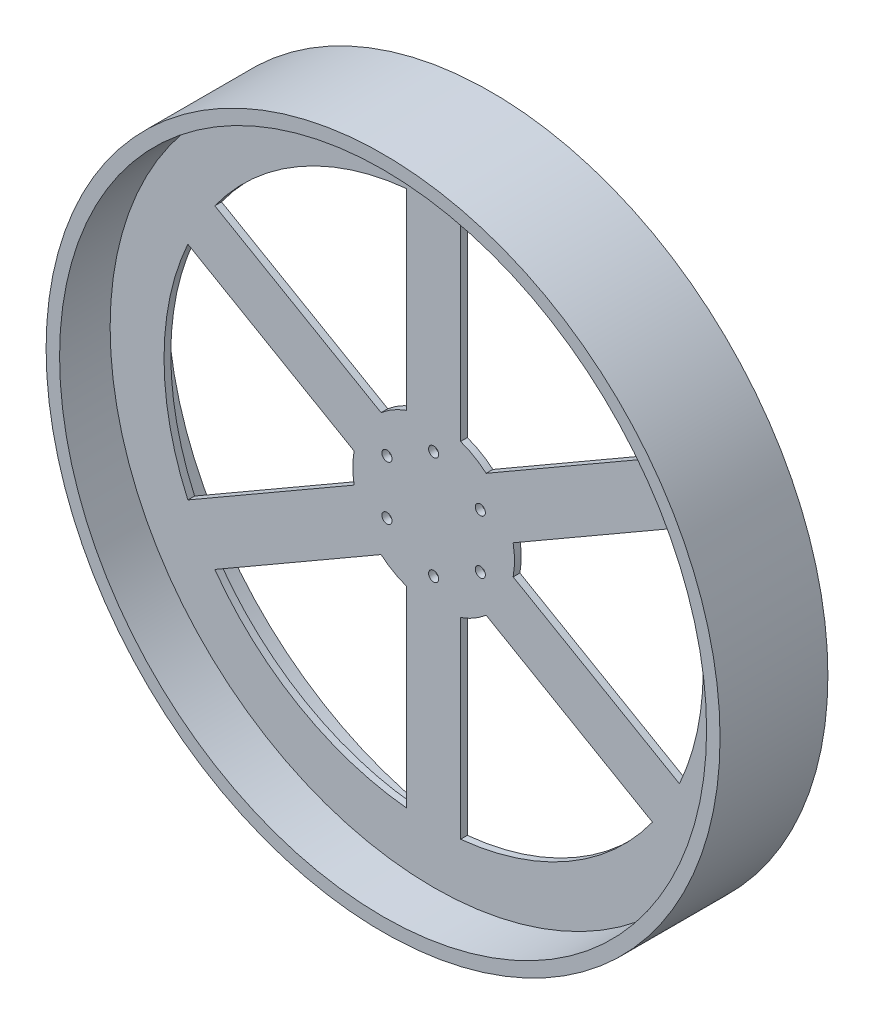
ISO-10303-21;
HEADER;
FILE_DESCRIPTION(('STEP AP214'),'2;1');
FILE_NAME('part.step','',(''),(''),'','','');
FILE_SCHEMA(('AUTOMOTIVE_DESIGN { 1 0 10303 214 1 1 1 1 }'));
ENDSEC;
DATA;
#1=APPLICATION_CONTEXT('core data for automotive mechanical design processes');
#2=APPLICATION_PROTOCOL_DEFINITION('international standard','automotive_design',2000,#1);
#3=PRODUCT_CONTEXT('',#1,'mechanical');
#4=PRODUCT('Part','Part','',(#3));
#5=PRODUCT_RELATED_PRODUCT_CATEGORY('part','',(#4));
#6=PRODUCT_DEFINITION_FORMATION('','',#4);
#7=PRODUCT_DEFINITION_CONTEXT('part definition',#1,'design');
#8=PRODUCT_DEFINITION('design','',#6,#7);
#9=PRODUCT_DEFINITION_SHAPE('','',#8);
#10=(LENGTH_UNIT() NAMED_UNIT(*) SI_UNIT(.MILLI.,.METRE.));
#11=(NAMED_UNIT(*) PLANE_ANGLE_UNIT() SI_UNIT($,.RADIAN.));
#12=(NAMED_UNIT(*) SI_UNIT($,.STERADIAN.) SOLID_ANGLE_UNIT());
#13=UNCERTAINTY_MEASURE_WITH_UNIT(LENGTH_MEASURE(1.E-05),#10,'distance_accuracy_value','');
#14=(GEOMETRIC_REPRESENTATION_CONTEXT(3) GLOBAL_UNCERTAINTY_ASSIGNED_CONTEXT((#13)) GLOBAL_UNIT_ASSIGNED_CONTEXT((#10,
#11,#12)) REPRESENTATION_CONTEXT('',''));
#15=CARTESIAN_POINT('',(0.,0.,0.));
#16=DIRECTION('',(0.,0.,1.));
#17=DIRECTION('',(1.,0.,0.));
#18=AXIS2_PLACEMENT_3D('',#15,#16,#17);
#19=CARTESIAN_POINT('',(0.,0.,-3.175));
#20=DIRECTION('',(0.,0.,1.));
#21=DIRECTION('',(1.,0.,0.));
#22=AXIS2_PLACEMENT_3D('',#19,#20,#21);
#23=CYLINDRICAL_SURFACE('',#22,76.2);
#24=DIRECTION('',(0.,0.,1.));
#25=VECTOR('',#24,1.);
#26=CARTESIAN_POINT('',(25.4000000000005,71.8420489685531,-3.175));
#27=LINE('',#26,#25);
#28=CARTESIAN_POINT('',(25.4000000000005,71.8420489685531,-3.175));
#29=VERTEX_POINT('',#28);
#30=CARTESIAN_POINT('',(25.4000000000005,71.8420489685531,3.175));
#31=VERTEX_POINT('',#30);
#32=EDGE_CURVE('E328',#29,#31,#27,.T.);
#33=ORIENTED_EDGE('',*,*,#32,.T.);
#34=CARTESIAN_POINT('',(0.,0.,3.175));
#35=DIRECTION('',(0.,0.,1.));
#36=DIRECTION('',(1.,0.,0.));
#37=AXIS2_PLACEMENT_3D('',#34,#35,#36);
#38=CIRCLE('',#37,76.2);
#39=CARTESIAN_POINT('',(49.5170394666933,57.9180697404009,3.175));
#40=VERTEX_POINT('',#39);
#41=EDGE_CURVE('E220',#40,#31,#38,.T.);
#42=ORIENTED_EDGE('',*,*,#41,.F.);
#43=DIRECTION('',(0.,0.,1.));
#44=VECTOR('',#43,1.);
#45=CARTESIAN_POINT('',(49.5170394666933,57.9180697404009,-3.175));
#46=LINE('',#45,#44);
#47=CARTESIAN_POINT('',(49.5170394666933,57.9180697404009,-3.175));
#48=VERTEX_POINT('',#47);
#49=EDGE_CURVE('E11',#48,#40,#46,.T.);
#50=ORIENTED_EDGE('',*,*,#49,.F.);
#51=CARTESIAN_POINT('',(0.,0.,-3.175));
#52=DIRECTION('',(0.,0.,1.));
#53=DIRECTION('',(1.,0.,0.));
#54=AXIS2_PLACEMENT_3D('',#51,#52,#53);
#55=CIRCLE('',#54,76.2);
#56=EDGE_CURVE('E279',#48,#29,#55,.T.);
#57=ORIENTED_EDGE('',*,*,#56,.T.);
#58=EDGE_LOOP('',(#33,#42,#50,#57));
#59=FACE_BOUND('',#58,.T.);
#60=ADVANCED_FACE('F38',(#59),#23,.T.);
#61=CARTESIAN_POINT('',(-12.6999999999998,21.9970452561249,-3.175));
#62=DIRECTION('',(0.499999999999992,-0.866025403784443,0.));
#63=DIRECTION('',(0.866025403784443,0.499999999999992,0.));
#64=AXIS2_PLACEMENT_3D('',#61,#62,#63);
#65=PLANE('',#64);
#66=ORIENTED_EDGE('',*,*,#49,.T.);
#67=DIRECTION('',(0.866025403784443,0.499999999999992,0.));
#68=VECTOR('',#67,1.);
#69=CARTESIAN_POINT('',(-12.6999999999998,21.9970452561249,3.175));
#70=LINE('',#69,#68);
#71=CARTESIAN_POINT('',(206.1678368331,148.360449768664,3.175));
#72=VERTEX_POINT('',#71);
#73=EDGE_CURVE('E272',#40,#72,#70,.T.);
#74=ORIENTED_EDGE('',*,*,#73,.T.);
#75=DIRECTION('',(0.,0.,1.));
#76=VECTOR('',#75,1.);
#77=CARTESIAN_POINT('',(206.1678368331,148.360449768664,-3.175));
#78=LINE('',#77,#76);
#79=CARTESIAN_POINT('',(206.1678368331,148.360449768664,-3.175));
#80=VERTEX_POINT('',#79);
#81=EDGE_CURVE('E47',#80,#72,#78,.T.);
#82=ORIENTED_EDGE('',*,*,#81,.F.);
#83=DIRECTION('',(0.866025403784443,0.499999999999992,0.));
#84=VECTOR('',#83,1.);
#85=CARTESIAN_POINT('',(-12.6999999999998,21.9970452561249,-3.175));
#86=LINE('',#85,#84);
#87=EDGE_CURVE('E321',#48,#80,#86,.T.);
#88=ORIENTED_EDGE('',*,*,#87,.F.);
#89=EDGE_LOOP('',(#66,#74,#82,#88));
#90=FACE_BOUND('',#89,.T.);
#91=ADVANCED_FACE('F420',(#90),#65,.F.);
#92=CARTESIAN_POINT('',(0.,0.,-3.175));
#93=DIRECTION('',(0.,0.,1.));
#94=DIRECTION('',(1.,0.,0.));
#95=AXIS2_PLACEMENT_3D('',#92,#93,#94);
#96=CYLINDRICAL_SURFACE('',#95,254.);
#97=ORIENTED_EDGE('',*,*,#81,.T.);
#98=CARTESIAN_POINT('',(0.,0.,3.175));
#99=DIRECTION('',(0.,0.,1.));
#100=DIRECTION('',(1.,0.,0.));
#101=AXIS2_PLACEMENT_3D('',#98,#99,#100);
#102=CIRCLE('',#101,254.);
#103=CARTESIAN_POINT('',(25.4000000000017,252.726809025081,3.175));
#104=VERTEX_POINT('',#103);
#105=EDGE_CURVE('E236',#72,#104,#102,.T.);
#106=ORIENTED_EDGE('',*,*,#105,.T.);
#107=DIRECTION('',(0.,0.,1.));
#108=VECTOR('',#107,1.);
#109=CARTESIAN_POINT('',(25.4000000000017,252.726809025081,-3.175));
#110=LINE('',#109,#108);
#111=CARTESIAN_POINT('',(25.4000000000017,252.726809025081,-3.175));
#112=VERTEX_POINT('',#111);
#113=EDGE_CURVE('E326',#112,#104,#110,.T.);
#114=ORIENTED_EDGE('',*,*,#113,.F.);
#115=CARTESIAN_POINT('',(0.,0.,-3.175));
#116=DIRECTION('',(0.,0.,1.));
#117=DIRECTION('',(1.,0.,0.));
#118=AXIS2_PLACEMENT_3D('',#115,#116,#117);
#119=CIRCLE('',#118,254.);
#120=EDGE_CURVE('E61',#80,#112,#119,.T.);
#121=ORIENTED_EDGE('',*,*,#120,.F.);
#122=EDGE_LOOP('',(#97,#106,#114,#121));
#123=FACE_BOUND('',#122,.T.);
#124=ADVANCED_FACE('F426',(#123),#96,.F.);
#125=CARTESIAN_POINT('',(-25.4,1.70513996829964E-13,-3.175));
#126=DIRECTION('',(1.,0.,0.));
#127=DIRECTION('',(0.,1.,0.));
#128=AXIS2_PLACEMENT_3D('',#125,#126,#127);
#129=PLANE('',#128);
#130=DIRECTION('',(0.,0.,1.));
#131=VECTOR('',#130,1.);
#132=CARTESIAN_POINT('',(-25.3999999999996,71.8420489685534,-3.175));
#133=LINE('',#132,#131);
#134=CARTESIAN_POINT('',(-25.3999999999996,71.8420489685534,-3.175));
#135=VERTEX_POINT('',#134);
#136=CARTESIAN_POINT('',(-25.3999999999996,71.8420489685534,3.175));
#137=VERTEX_POINT('',#136);
#138=EDGE_CURVE('E336',#135,#137,#133,.T.);
#139=ORIENTED_EDGE('',*,*,#138,.T.);
#140=DIRECTION('',(0.,1.,0.));
#141=VECTOR('',#140,1.);
#142=CARTESIAN_POINT('',(-25.4,1.70513996829964E-13,3.175));
#143=LINE('',#142,#141);
#144=CARTESIAN_POINT('',(-25.3999999999983,252.726809025082,3.175));
#145=VERTEX_POINT('',#144);
#146=EDGE_CURVE('E261',#137,#145,#143,.T.);
#147=ORIENTED_EDGE('',*,*,#146,.T.);
#148=DIRECTION('',(0.,0.,1.));
#149=VECTOR('',#148,1.);
#150=CARTESIAN_POINT('',(-25.3999999999983,252.726809025082,-3.175));
#151=LINE('',#150,#149);
#152=CARTESIAN_POINT('',(-25.3999999999983,252.726809025082,-3.175));
#153=VERTEX_POINT('',#152);
#154=EDGE_CURVE('E330',#153,#145,#151,.T.);
#155=ORIENTED_EDGE('',*,*,#154,.F.);
#156=DIRECTION('',(0.,1.,0.));
#157=VECTOR('',#156,1.);
#158=CARTESIAN_POINT('',(-25.4,1.70513996829964E-13,-3.175));
#159=LINE('',#158,#157);
#160=EDGE_CURVE('E310',#135,#153,#159,.T.);
#161=ORIENTED_EDGE('',*,*,#160,.F.);
#162=EDGE_LOOP('',(#139,#147,#155,#161));
#163=FACE_BOUND('',#162,.T.);
#164=ADVANCED_FACE('F521',(#163),#129,.F.);
#165=ORIENTED_EDGE('',*,*,#154,.T.);
#166=CARTESIAN_POINT('',(-206.167836833098,148.360449768666,3.175));
#167=VERTEX_POINT('',#166);
#168=EDGE_CURVE('E268',#145,#167,#102,.T.);
#169=ORIENTED_EDGE('',*,*,#168,.T.);
#170=DIRECTION('',(0.,0.,1.));
#171=VECTOR('',#170,1.);
#172=CARTESIAN_POINT('',(-206.167836833098,148.360449768666,-3.175));
#173=LINE('',#172,#171);
#174=CARTESIAN_POINT('',(-206.167836833098,148.360449768666,-3.175));
#175=VERTEX_POINT('',#174);
#176=EDGE_CURVE('E332',#175,#167,#173,.T.);
#177=ORIENTED_EDGE('',*,*,#176,.F.);
#178=EDGE_CURVE('E317',#153,#175,#119,.T.);
#179=ORIENTED_EDGE('',*,*,#178,.F.);
#180=EDGE_LOOP('',(#165,#169,#177,#179));
#181=FACE_BOUND('',#180,.T.);
#182=ADVANCED_FACE('F512',(#181),#96,.F.);
#183=CARTESIAN_POINT('',(12.7000000000001,21.9970452561247,-3.175));
#184=DIRECTION('',(0.500000000000004,0.866025403784436,0.));
#185=DIRECTION('',(-0.866025403784437,0.500000000000004,0.));
#186=AXIS2_PLACEMENT_3D('',#183,#184,#185);
#187=PLANE('',#186);
#188=ORIENTED_EDGE('',*,*,#176,.T.);
#189=DIRECTION('',(-0.866025403784436,0.500000000000004,0.));
#190=VECTOR('',#189,1.);
#191=CARTESIAN_POINT('',(12.7000000000001,21.9970452561247,3.175));
#192=LINE('',#191,#190);
#193=CARTESIAN_POINT('',(-49.5170394666925,57.9180697404016,3.175));
#194=VERTEX_POINT('',#193);
#195=EDGE_CURVE('E265',#194,#167,#192,.T.);
#196=ORIENTED_EDGE('',*,*,#195,.F.);
#197=DIRECTION('',(0.,0.,1.));
#198=VECTOR('',#197,1.);
#199=CARTESIAN_POINT('',(-49.5170394666925,57.9180697404016,-3.175));
#200=LINE('',#199,#198);
#201=CARTESIAN_POINT('',(-49.5170394666925,57.9180697404016,-3.175));
#202=VERTEX_POINT('',#201);
#203=EDGE_CURVE('E334',#202,#194,#200,.T.);
#204=ORIENTED_EDGE('',*,*,#203,.F.);
#205=DIRECTION('',(-0.866025403784436,0.500000000000004,0.));
#206=VECTOR('',#205,1.);
#207=CARTESIAN_POINT('',(12.7000000000001,21.9970452561247,-3.175));
#208=LINE('',#207,#206);
#209=EDGE_CURVE('E314',#202,#175,#208,.T.);
#210=ORIENTED_EDGE('',*,*,#209,.T.);
#211=EDGE_LOOP('',(#188,#196,#204,#210));
#212=FACE_BOUND('',#211,.T.);
#213=ADVANCED_FACE('F451',(#212),#187,.T.);
#214=CARTESIAN_POINT('',(-12.7000000000001,-21.9970452561247,-3.175));
#215=DIRECTION('',(0.500000000000004,0.866025403784436,0.));
#216=DIRECTION('',(-0.866025403784437,0.500000000000004,0.));
#217=AXIS2_PLACEMENT_3D('',#214,#215,#216);
#218=PLANE('',#217);
#219=DIRECTION('',(0.,0.,1.));
#220=VECTOR('',#219,1.);
#221=CARTESIAN_POINT('',(-74.9170394666927,13.9239792281522,-3.175));
#222=LINE('',#221,#220);
#223=CARTESIAN_POINT('',(-74.9170394666927,13.9239792281522,-3.175));
#224=VERTEX_POINT('',#223);
#225=CARTESIAN_POINT('',(-74.9170394666927,13.9239792281522,3.175));
#226=VERTEX_POINT('',#225);
#227=EDGE_CURVE('E344',#224,#226,#222,.T.);
#228=ORIENTED_EDGE('',*,*,#227,.T.);
#229=DIRECTION('',(-0.866025403784436,0.500000000000004,0.));
#230=VECTOR('',#229,1.);
#231=CARTESIAN_POINT('',(-12.7000000000001,-21.9970452561247,3.175));
#232=LINE('',#231,#230);
#233=CARTESIAN_POINT('',(-231.567836833098,104.366359256417,3.175));
#234=VERTEX_POINT('',#233);
#235=EDGE_CURVE('E253',#226,#234,#232,.T.);
#236=ORIENTED_EDGE('',*,*,#235,.T.);
#237=DIRECTION('',(0.,0.,1.));
#238=VECTOR('',#237,1.);
#239=CARTESIAN_POINT('',(-231.567836833098,104.366359256417,-3.175));
#240=LINE('',#239,#238);
#241=CARTESIAN_POINT('',(-231.567836833098,104.366359256417,-3.175));
#242=VERTEX_POINT('',#241);
#243=EDGE_CURVE('E338',#242,#234,#240,.T.);
#244=ORIENTED_EDGE('',*,*,#243,.F.);
#245=DIRECTION('',(-0.866025403784436,0.500000000000004,0.));
#246=VECTOR('',#245,1.);
#247=CARTESIAN_POINT('',(-12.7000000000001,-21.9970452561247,-3.175));
#248=LINE('',#247,#246);
#249=EDGE_CURVE('E302',#224,#242,#248,.T.);
#250=ORIENTED_EDGE('',*,*,#249,.F.);
#251=EDGE_LOOP('',(#228,#236,#244,#250));
#252=FACE_BOUND('',#251,.T.);
#253=ADVANCED_FACE('F507',(#252),#218,.F.);
#254=ORIENTED_EDGE('',*,*,#243,.T.);
#255=CARTESIAN_POINT('',(-231.567836833099,-104.366359256416,3.175));
#256=VERTEX_POINT('',#255);
#257=EDGE_CURVE('E260',#234,#256,#102,.T.);
#258=ORIENTED_EDGE('',*,*,#257,.T.);
#259=DIRECTION('',(0.,0.,1.));
#260=VECTOR('',#259,1.);
#261=CARTESIAN_POINT('',(-231.567836833099,-104.366359256416,-3.175));
#262=LINE('',#261,#260);
#263=CARTESIAN_POINT('',(-231.567836833099,-104.366359256416,-3.175));
#264=VERTEX_POINT('',#263);
#265=EDGE_CURVE('E340',#264,#256,#262,.T.);
#266=ORIENTED_EDGE('',*,*,#265,.F.);
#267=EDGE_CURVE('E309',#242,#264,#119,.T.);
#268=ORIENTED_EDGE('',*,*,#267,.F.);
#269=EDGE_LOOP('',(#254,#258,#266,#268));
#270=FACE_BOUND('',#269,.T.);
#271=ADVANCED_FACE('F509',(#270),#96,.F.);
#272=CARTESIAN_POINT('',(-12.7,21.9970452561248,-3.175));
#273=DIRECTION('',(-0.499999999999998,0.866025403784439,0.));
#274=DIRECTION('',(-0.86602540378444,-0.499999999999999,0.));
#275=AXIS2_PLACEMENT_3D('',#272,#273,#274);
#276=PLANE('',#275);
#277=ORIENTED_EDGE('',*,*,#265,.T.);
#278=DIRECTION('',(-0.86602540378444,-0.499999999999998,0.));
#279=VECTOR('',#278,1.);
#280=CARTESIAN_POINT('',(-12.7,21.9970452561248,3.175));
#281=LINE('',#280,#279);
#282=CARTESIAN_POINT('',(-74.9170394666928,-13.9239792281517,3.175));
#283=VERTEX_POINT('',#282);
#284=EDGE_CURVE('E257',#283,#256,#281,.T.);
#285=ORIENTED_EDGE('',*,*,#284,.F.);
#286=DIRECTION('',(0.,0.,1.));
#287=VECTOR('',#286,1.);
#288=CARTESIAN_POINT('',(-74.9170394666928,-13.9239792281517,-3.175));
#289=LINE('',#288,#287);
#290=CARTESIAN_POINT('',(-74.9170394666928,-13.9239792281517,-3.175));
#291=VERTEX_POINT('',#290);
#292=EDGE_CURVE('E342',#291,#283,#289,.T.);
#293=ORIENTED_EDGE('',*,*,#292,.F.);
#294=DIRECTION('',(-0.86602540378444,-0.499999999999998,0.));
#295=VECTOR('',#294,1.);
#296=CARTESIAN_POINT('',(-12.7,21.9970452561248,-3.175));
#297=LINE('',#296,#295);
#298=EDGE_CURVE('E306',#291,#264,#297,.T.);
#299=ORIENTED_EDGE('',*,*,#298,.T.);
#300=EDGE_LOOP('',(#277,#285,#293,#299));
#301=FACE_BOUND('',#300,.T.);
#302=ADVANCED_FACE('F503',(#301),#276,.T.);
#303=CARTESIAN_POINT('',(12.7,-21.9970452561248,-3.175));
#304=DIRECTION('',(-0.499999999999998,0.86602540378444,0.));
#305=DIRECTION('',(-0.86602540378444,-0.499999999999998,0.));
#306=AXIS2_PLACEMENT_3D('',#303,#304,#305);
#307=PLANE('',#306);
#308=DIRECTION('',(0.,0.,1.));
#309=VECTOR('',#308,1.);
#310=CARTESIAN_POINT('',(-49.5170394666928,-57.9180697404013,-3.175));
#311=LINE('',#310,#309);
#312=CARTESIAN_POINT('',(-49.5170394666928,-57.9180697404013,-3.175));
#313=VERTEX_POINT('',#312);
#314=CARTESIAN_POINT('',(-49.5170394666928,-57.9180697404013,3.175));
#315=VERTEX_POINT('',#314);
#316=EDGE_CURVE('E352',#313,#315,#311,.T.);
#317=ORIENTED_EDGE('',*,*,#316,.T.);
#318=DIRECTION('',(-0.86602540378444,-0.499999999999998,0.));
#319=VECTOR('',#318,1.);
#320=CARTESIAN_POINT('',(12.7,-21.9970452561248,3.175));
#321=LINE('',#320,#319);
#322=CARTESIAN_POINT('',(-206.167836833099,-148.360449768665,3.175));
#323=VERTEX_POINT('',#322);
#324=EDGE_CURVE('E246',#315,#323,#321,.T.);
#325=ORIENTED_EDGE('',*,*,#324,.T.);
#326=DIRECTION('',(0.,0.,1.));
#327=VECTOR('',#326,1.);
#328=CARTESIAN_POINT('',(-206.167836833099,-148.360449768665,-3.175));
#329=LINE('',#328,#327);
#330=CARTESIAN_POINT('',(-206.167836833099,-148.360449768665,-3.175));
#331=VERTEX_POINT('',#330);
#332=EDGE_CURVE('E346',#331,#323,#329,.T.);
#333=ORIENTED_EDGE('',*,*,#332,.F.);
#334=DIRECTION('',(-0.86602540378444,-0.499999999999998,0.));
#335=VECTOR('',#334,1.);
#336=CARTESIAN_POINT('',(12.7,-21.9970452561248,-3.175));
#337=LINE('',#336,#335);
#338=EDGE_CURVE('E295',#313,#331,#337,.T.);
#339=ORIENTED_EDGE('',*,*,#338,.F.);
#340=EDGE_LOOP('',(#317,#325,#333,#339));
#341=FACE_BOUND('',#340,.T.);
#342=ADVANCED_FACE('F517',(#341),#307,.F.);
#343=ORIENTED_EDGE('',*,*,#332,.T.);
#344=CARTESIAN_POINT('',(-25.4,-252.726809025081,3.175));
#345=VERTEX_POINT('',#344);
#346=EDGE_CURVE('E252',#323,#345,#102,.T.);
#347=ORIENTED_EDGE('',*,*,#346,.T.);
#348=DIRECTION('',(0.,0.,1.));
#349=VECTOR('',#348,1.);
#350=CARTESIAN_POINT('',(-25.4,-252.726809025081,-3.175));
#351=LINE('',#350,#349);
#352=CARTESIAN_POINT('',(-25.4,-252.726809025081,-3.175));
#353=VERTEX_POINT('',#352);
#354=EDGE_CURVE('E348',#353,#345,#351,.T.);
#355=ORIENTED_EDGE('',*,*,#354,.F.);
#356=EDGE_CURVE('E301',#331,#353,#119,.T.);
#357=ORIENTED_EDGE('',*,*,#356,.F.);
#358=EDGE_LOOP('',(#343,#347,#355,#357));
#359=FACE_BOUND('',#358,.T.);
#360=ADVANCED_FACE('F489',(#359),#96,.F.);
#361=CARTESIAN_POINT('',(-25.4,0.,-3.175));
#362=DIRECTION('',(-1.,0.,0.));
#363=DIRECTION('',(0.,-1.,0.));
#364=AXIS2_PLACEMENT_3D('',#361,#362,#363);
#365=PLANE('',#364);
#366=ORIENTED_EDGE('',*,*,#354,.T.);
#367=DIRECTION('',(0.,-1.,0.));
#368=VECTOR('',#367,1.);
#369=CARTESIAN_POINT('',(-25.4,0.,3.175));
#370=LINE('',#369,#368);
#371=CARTESIAN_POINT('',(-25.4,-71.8420489685532,3.175));
#372=VERTEX_POINT('',#371);
#373=EDGE_CURVE('E249',#372,#345,#370,.T.);
#374=ORIENTED_EDGE('',*,*,#373,.F.);
#375=DIRECTION('',(0.,0.,1.));
#376=VECTOR('',#375,1.);
#377=CARTESIAN_POINT('',(-25.4,-71.8420489685532,-3.175));
#378=LINE('',#377,#376);
#379=CARTESIAN_POINT('',(-25.4,-71.8420489685532,-3.175));
#380=VERTEX_POINT('',#379);
#381=EDGE_CURVE('E350',#380,#372,#378,.T.);
#382=ORIENTED_EDGE('',*,*,#381,.F.);
#383=DIRECTION('',(0.,-1.,0.));
#384=VECTOR('',#383,1.);
#385=CARTESIAN_POINT('',(-25.4,0.,-3.175));
#386=LINE('',#385,#384);
#387=EDGE_CURVE('E298',#380,#353,#386,.T.);
#388=ORIENTED_EDGE('',*,*,#387,.T.);
#389=EDGE_LOOP('',(#366,#374,#382,#388));
#390=FACE_BOUND('',#389,.T.);
#391=ADVANCED_FACE('F496',(#390),#365,.T.);
#392=CARTESIAN_POINT('',(25.4,0.,-3.175));
#393=DIRECTION('',(-1.,0.,0.));
#394=DIRECTION('',(0.,-1.,0.));
#395=AXIS2_PLACEMENT_3D('',#392,#393,#394);
#396=PLANE('',#395);
#397=DIRECTION('',(0.,0.,1.));
#398=VECTOR('',#397,1.);
#399=CARTESIAN_POINT('',(25.4,-71.8420489685532,-3.175));
#400=LINE('',#399,#398);
#401=CARTESIAN_POINT('',(25.4,-71.8420489685532,-3.175));
#402=VERTEX_POINT('',#401);
#403=CARTESIAN_POINT('',(25.4,-71.8420489685532,3.175));
#404=VERTEX_POINT('',#403);
#405=EDGE_CURVE('E360',#402,#404,#400,.T.);
#406=ORIENTED_EDGE('',*,*,#405,.T.);
#407=DIRECTION('',(0.,-1.,0.));
#408=VECTOR('',#407,1.);
#409=CARTESIAN_POINT('',(25.4,0.,3.175));
#410=LINE('',#409,#408);
#411=CARTESIAN_POINT('',(25.4,-252.726809025081,3.175));
#412=VERTEX_POINT('',#411);
#413=EDGE_CURVE('E235',#404,#412,#410,.T.);
#414=ORIENTED_EDGE('',*,*,#413,.T.);
#415=DIRECTION('',(0.,0.,1.));
#416=VECTOR('',#415,1.);
#417=CARTESIAN_POINT('',(25.4,-252.726809025081,-3.175));
#418=LINE('',#417,#416);
#419=CARTESIAN_POINT('',(25.4,-252.726809025081,-3.175));
#420=VERTEX_POINT('',#419);
#421=EDGE_CURVE('E354',#420,#412,#418,.T.);
#422=ORIENTED_EDGE('',*,*,#421,.F.);
#423=DIRECTION('',(0.,-1.,0.));
#424=VECTOR('',#423,1.);
#425=CARTESIAN_POINT('',(25.4,0.,-3.175));
#426=LINE('',#425,#424);
#427=EDGE_CURVE('E285',#402,#420,#426,.T.);
#428=ORIENTED_EDGE('',*,*,#427,.F.);
#429=EDGE_LOOP('',(#406,#414,#422,#428));
#430=FACE_BOUND('',#429,.T.);
#431=ADVANCED_FACE('F484',(#430),#396,.F.);
#432=ORIENTED_EDGE('',*,*,#421,.T.);
#433=CARTESIAN_POINT('',(206.167836833099,-148.360449768665,3.175));
#434=VERTEX_POINT('',#433);
#435=EDGE_CURVE('E237',#412,#434,#102,.T.);
#436=ORIENTED_EDGE('',*,*,#435,.T.);
#437=DIRECTION('',(0.,0.,1.));
#438=VECTOR('',#437,1.);
#439=CARTESIAN_POINT('',(206.167836833099,-148.360449768665,-3.175));
#440=LINE('',#439,#438);
#441=CARTESIAN_POINT('',(206.167836833099,-148.360449768665,-3.175));
#442=VERTEX_POINT('',#441);
#443=EDGE_CURVE('E356',#442,#434,#440,.T.);
#444=ORIENTED_EDGE('',*,*,#443,.F.);
#445=EDGE_CURVE('E286',#420,#442,#119,.T.);
#446=ORIENTED_EDGE('',*,*,#445,.F.);
#447=EDGE_LOOP('',(#432,#436,#444,#446));
#448=FACE_BOUND('',#447,.T.);
#449=ADVANCED_FACE('F475',(#448),#96,.F.);
#450=CARTESIAN_POINT('',(-12.7,-21.9970452561248,-3.175));
#451=DIRECTION('',(-0.499999999999997,-0.86602540378444,0.));
#452=DIRECTION('',(0.86602540378444,-0.499999999999998,0.));
#453=AXIS2_PLACEMENT_3D('',#450,#451,#452);
#454=PLANE('',#453);
#455=ORIENTED_EDGE('',*,*,#443,.T.);
#456=DIRECTION('',(0.86602540378444,-0.499999999999997,0.));
#457=VECTOR('',#456,1.);
#458=CARTESIAN_POINT('',(-12.7,-21.9970452561248,3.175));
#459=LINE('',#458,#457);
#460=CARTESIAN_POINT('',(49.5170394666929,-57.9180697404013,3.175));
#461=VERTEX_POINT('',#460);
#462=EDGE_CURVE('E243',#461,#434,#459,.T.);
#463=ORIENTED_EDGE('',*,*,#462,.F.);
#464=DIRECTION('',(0.,0.,1.));
#465=VECTOR('',#464,1.);
#466=CARTESIAN_POINT('',(49.5170394666929,-57.9180697404013,-3.175));
#467=LINE('',#466,#465);
#468=CARTESIAN_POINT('',(49.5170394666929,-57.9180697404013,-3.175));
#469=VERTEX_POINT('',#468);
#470=EDGE_CURVE('E358',#469,#461,#467,.T.);
#471=ORIENTED_EDGE('',*,*,#470,.F.);
#472=DIRECTION('',(0.86602540378444,-0.499999999999997,0.));
#473=VECTOR('',#472,1.);
#474=CARTESIAN_POINT('',(-12.7,-21.9970452561248,-3.175));
#475=LINE('',#474,#473);
#476=EDGE_CURVE('E292',#469,#442,#475,.T.);
#477=ORIENTED_EDGE('',*,*,#476,.T.);
#478=EDGE_LOOP('',(#455,#463,#471,#477));
#479=FACE_BOUND('',#478,.T.);
#480=ADVANCED_FACE('F479',(#479),#454,.T.);
#481=CARTESIAN_POINT('',(12.7,21.9970452561248,-3.175));
#482=DIRECTION('',(-0.499999999999998,-0.86602540378444,0.));
#483=DIRECTION('',(0.86602540378444,-0.499999999999998,0.));
#484=AXIS2_PLACEMENT_3D('',#481,#482,#483);
#485=PLANE('',#484);
#486=DIRECTION('',(0.,0.,1.));
#487=VECTOR('',#486,1.);
#488=CARTESIAN_POINT('',(74.9170394666928,-13.9239792281516,-3.175));
#489=LINE('',#488,#487);
#490=CARTESIAN_POINT('',(74.9170394666928,-13.9239792281516,-3.175));
#491=VERTEX_POINT('',#490);
#492=CARTESIAN_POINT('',(74.9170394666928,-13.9239792281516,3.175));
#493=VERTEX_POINT('',#492);
#494=EDGE_CURVE('E42',#491,#493,#489,.T.);
#495=ORIENTED_EDGE('',*,*,#494,.T.);
#496=DIRECTION('',(0.86602540378444,-0.499999999999998,0.));
#497=VECTOR('',#496,1.);
#498=CARTESIAN_POINT('',(12.7,21.9970452561248,3.175));
#499=LINE('',#498,#497);
#500=CARTESIAN_POINT('',(231.567836833099,-104.366359256415,3.175));
#501=VERTEX_POINT('',#500);
#502=EDGE_CURVE('E203',#493,#501,#499,.T.);
#503=ORIENTED_EDGE('',*,*,#502,.T.);
#504=DIRECTION('',(0.,0.,1.));
#505=VECTOR('',#504,1.);
#506=CARTESIAN_POINT('',(231.567836833099,-104.366359256415,-3.175));
#507=LINE('',#506,#505);
#508=CARTESIAN_POINT('',(231.567836833099,-104.366359256415,-3.175));
#509=VERTEX_POINT('',#508);
#510=EDGE_CURVE('E362',#509,#501,#507,.T.);
#511=ORIENTED_EDGE('',*,*,#510,.F.);
#512=DIRECTION('',(0.86602540378444,-0.499999999999998,0.));
#513=VECTOR('',#512,1.);
#514=CARTESIAN_POINT('',(12.7,21.9970452561248,-3.175));
#515=LINE('',#514,#513);
#516=EDGE_CURVE('E206',#491,#509,#515,.T.);
#517=ORIENTED_EDGE('',*,*,#516,.F.);
#518=EDGE_LOOP('',(#495,#503,#511,#517));
#519=FACE_BOUND('',#518,.T.);
#520=ADVANCED_FACE('F40',(#519),#485,.F.);
#521=ORIENTED_EDGE('',*,*,#510,.T.);
#522=CARTESIAN_POINT('',(231.5678368331,104.366359256414,3.175));
#523=VERTEX_POINT('',#522);
#524=EDGE_CURVE('E225',#501,#523,#102,.T.);
#525=ORIENTED_EDGE('',*,*,#524,.T.);
#526=DIRECTION('',(0.,0.,1.));
#527=VECTOR('',#526,1.);
#528=CARTESIAN_POINT('',(231.5678368331,104.366359256414,-3.175));
#529=LINE('',#528,#527);
#530=CARTESIAN_POINT('',(231.5678368331,104.366359256414,-3.175));
#531=VERTEX_POINT('',#530);
#532=EDGE_CURVE('E364',#531,#523,#529,.T.);
#533=ORIENTED_EDGE('',*,*,#532,.F.);
#534=EDGE_CURVE('E283',#509,#531,#119,.T.);
#535=ORIENTED_EDGE('',*,*,#534,.F.);
#536=EDGE_LOOP('',(#521,#525,#533,#535));
#537=FACE_BOUND('',#536,.T.);
#538=ADVANCED_FACE('F370',(#537),#96,.F.);
#539=CARTESIAN_POINT('',(12.6999999999998,-21.9970452561248,-3.175));
#540=DIRECTION('',(0.499999999999992,-0.866025403784443,0.));
#541=DIRECTION('',(0.866025403784443,0.499999999999992,0.));
#542=AXIS2_PLACEMENT_3D('',#539,#540,#541);
#543=PLANE('',#542);
#544=ORIENTED_EDGE('',*,*,#532,.T.);
#545=DIRECTION('',(0.866025403784443,0.499999999999992,0.));
#546=VECTOR('',#545,1.);
#547=CARTESIAN_POINT('',(12.6999999999998,-21.9970452561248,3.175));
#548=LINE('',#547,#546);
#549=CARTESIAN_POINT('',(74.9170394666928,13.9239792281512,3.175));
#550=VERTEX_POINT('',#549);
#551=EDGE_CURVE('E218',#550,#523,#548,.T.);
#552=ORIENTED_EDGE('',*,*,#551,.F.);
#553=DIRECTION('',(0.,0.,1.));
#554=VECTOR('',#553,1.);
#555=CARTESIAN_POINT('',(74.9170394666928,13.9239792281512,-3.175));
#556=LINE('',#555,#554);
#557=CARTESIAN_POINT('',(74.9170394666928,13.9239792281512,-3.175));
#558=VERTEX_POINT('',#557);
#559=EDGE_CURVE('E210',#558,#550,#556,.T.);
#560=ORIENTED_EDGE('',*,*,#559,.F.);
#561=DIRECTION('',(0.866025403784443,0.499999999999992,0.));
#562=VECTOR('',#561,1.);
#563=CARTESIAN_POINT('',(12.6999999999998,-21.9970452561248,-3.175));
#564=LINE('',#563,#562);
#565=EDGE_CURVE('E278',#558,#531,#564,.T.);
#566=ORIENTED_EDGE('',*,*,#565,.T.);
#567=EDGE_LOOP('',(#544,#552,#560,#566));
#568=FACE_BOUND('',#567,.T.);
#569=ADVANCED_FACE('F367',(#568),#543,.T.);
#570=CARTESIAN_POINT('',(25.4,-1.64667802652937E-13,-3.175));
#571=DIRECTION('',(1.,0.,0.));
#572=DIRECTION('',(0.,1.,0.));
#573=AXIS2_PLACEMENT_3D('',#570,#571,#572);
#574=PLANE('',#573);
#575=ORIENTED_EDGE('',*,*,#113,.T.);
#576=DIRECTION('',(0.,1.,0.));
#577=VECTOR('',#576,1.);
#578=CARTESIAN_POINT('',(25.4,-1.64667802652937E-13,3.175));
#579=LINE('',#578,#577);
#580=EDGE_CURVE('E269',#31,#104,#579,.T.);
#581=ORIENTED_EDGE('',*,*,#580,.F.);
#582=ORIENTED_EDGE('',*,*,#32,.F.);
#583=DIRECTION('',(0.,1.,0.));
#584=VECTOR('',#583,1.);
#585=CARTESIAN_POINT('',(25.4,-1.64667802652937E-13,-3.175));
#586=LINE('',#585,#584);
#587=EDGE_CURVE('E318',#29,#112,#586,.T.);
#588=ORIENTED_EDGE('',*,*,#587,.T.);
#589=EDGE_LOOP('',(#575,#581,#582,#588));
#590=FACE_BOUND('',#589,.T.);
#591=ADVANCED_FACE('F436',(#590),#574,.T.);
#592=ORIENTED_EDGE('',*,*,#203,.T.);
#593=EDGE_CURVE('E264',#137,#194,#38,.T.);
#594=ORIENTED_EDGE('',*,*,#593,.F.);
#595=ORIENTED_EDGE('',*,*,#138,.F.);
#596=EDGE_CURVE('E313',#135,#202,#55,.T.);
#597=ORIENTED_EDGE('',*,*,#596,.T.);
#598=EDGE_LOOP('',(#592,#594,#595,#597));
#599=FACE_BOUND('',#598,.T.);
#600=ADVANCED_FACE('F422',(#599),#23,.T.);
#601=ORIENTED_EDGE('',*,*,#292,.T.);
#602=EDGE_CURVE('E256',#226,#283,#38,.T.);
#603=ORIENTED_EDGE('',*,*,#602,.F.);
#604=ORIENTED_EDGE('',*,*,#227,.F.);
#605=EDGE_CURVE('E305',#224,#291,#55,.T.);
#606=ORIENTED_EDGE('',*,*,#605,.T.);
#607=EDGE_LOOP('',(#601,#603,#604,#606));
#608=FACE_BOUND('',#607,.T.);
#609=ADVANCED_FACE('F435',(#608),#23,.T.);
#610=ORIENTED_EDGE('',*,*,#381,.T.);
#611=EDGE_CURVE('E221',#315,#372,#38,.T.);
#612=ORIENTED_EDGE('',*,*,#611,.F.);
#613=ORIENTED_EDGE('',*,*,#316,.F.);
#614=EDGE_CURVE('E280',#313,#380,#55,.T.);
#615=ORIENTED_EDGE('',*,*,#614,.T.);
#616=EDGE_LOOP('',(#610,#612,#613,#615));
#617=FACE_BOUND('',#616,.T.);
#618=ADVANCED_FACE('F433',(#617),#23,.T.);
#619=CARTESIAN_POINT('',(0.,0.,-3.175));
#620=DIRECTION('',(0.,0.,1.));
#621=DIRECTION('',(1.,0.,0.));
#622=AXIS2_PLACEMENT_3D('',#619,#620,#621);
#623=CYLINDRICAL_SURFACE('',#622,76.2);
#624=ORIENTED_EDGE('',*,*,#470,.T.);
#625=CARTESIAN_POINT('',(0.,0.,3.175));
#626=DIRECTION('',(0.,0.,1.));
#627=DIRECTION('',(1.,0.,0.));
#628=AXIS2_PLACEMENT_3D('',#625,#626,#627);
#629=CIRCLE('',#628,76.2);
#630=EDGE_CURVE('E240',#404,#461,#629,.T.);
#631=ORIENTED_EDGE('',*,*,#630,.F.);
#632=ORIENTED_EDGE('',*,*,#405,.F.);
#633=CARTESIAN_POINT('',(0.,0.,-3.175));
#634=DIRECTION('',(0.,0.,1.));
#635=DIRECTION('',(1.,0.,0.));
#636=AXIS2_PLACEMENT_3D('',#633,#634,#635);
#637=CIRCLE('',#636,76.2);
#638=EDGE_CURVE('E289',#402,#469,#637,.T.);
#639=ORIENTED_EDGE('',*,*,#638,.T.);
#640=EDGE_LOOP('',(#624,#631,#632,#639));
#641=FACE_BOUND('',#640,.T.);
#642=ADVANCED_FACE('F432',(#641),#623,.T.);
#643=ORIENTED_EDGE('',*,*,#559,.T.);
#644=EDGE_CURVE('E213',#493,#550,#38,.T.);
#645=ORIENTED_EDGE('',*,*,#644,.F.);
#646=ORIENTED_EDGE('',*,*,#494,.F.);
#647=EDGE_CURVE('E276',#491,#558,#55,.T.);
#648=ORIENTED_EDGE('',*,*,#647,.T.);
#649=EDGE_LOOP('',(#643,#645,#646,#648));
#650=FACE_BOUND('',#649,.T.);
#651=ADVANCED_FACE('F214',(#650),#23,.T.);
#652=CARTESIAN_POINT('',(0.,0.,-3.175));
#653=DIRECTION('',(0.,0.,1.));
#654=DIRECTION('',(1.,0.,0.));
#655=AXIS2_PLACEMENT_3D('',#652,#653,#654);
#656=PLANE('',#655);
#657=CARTESIAN_POINT('',(0.,50.8,-3.175));
#658=DIRECTION('',(0.,0.,1.));
#659=DIRECTION('',(1.,0.,0.));
#660=AXIS2_PLACEMENT_3D('',#657,#658,#659);
#661=CIRCLE('',#660,4.76249999999823);
#662=CARTESIAN_POINT('',(4.76249999999823,50.8,-3.175));
#663=VERTEX_POINT('',#662);
#664=EDGE_CURVE('E939',#663,#663,#661,.T.);
#665=ORIENTED_EDGE('',*,*,#664,.T.);
#666=EDGE_LOOP('',(#665));
#667=FACE_BOUND('',#666,.T.);
#668=CARTESIAN_POINT('',(-43.9940905122484,25.3999999999981,-3.175));
#669=DIRECTION('',(0.,0.,1.));
#670=DIRECTION('',(1.,0.,0.));
#671=AXIS2_PLACEMENT_3D('',#668,#669,#670);
#672=CIRCLE('',#671,4.76249999999823);
#673=CARTESIAN_POINT('',(-39.2315905122502,25.3999999999981,-3.175));
#674=VERTEX_POINT('',#673);
#675=EDGE_CURVE('E941',#674,#674,#672,.T.);
#676=ORIENTED_EDGE('',*,*,#675,.T.);
#677=EDGE_LOOP('',(#676));
#678=FACE_BOUND('',#677,.T.);
#679=CARTESIAN_POINT('',(-43.9940905122462,-25.4000000000019,-3.175));
#680=DIRECTION('',(0.,0.,1.));
#681=DIRECTION('',(1.,0.,0.));
#682=AXIS2_PLACEMENT_3D('',#679,#680,#681);
#683=CIRCLE('',#682,4.76249999999823);
#684=CARTESIAN_POINT('',(-39.231590512248,-25.4000000000019,-3.175));
#685=VERTEX_POINT('',#684);
#686=EDGE_CURVE('E947',#685,#685,#683,.T.);
#687=ORIENTED_EDGE('',*,*,#686,.T.);
#688=EDGE_LOOP('',(#687));
#689=FACE_BOUND('',#688,.T.);
#690=CARTESIAN_POINT('',(4.31902610571423E-12,-50.8,-3.175));
#691=DIRECTION('',(0.,0.,1.));
#692=DIRECTION('',(1.,0.,0.));
#693=AXIS2_PLACEMENT_3D('',#690,#691,#692);
#694=CIRCLE('',#693,4.76249999999823);
#695=CARTESIAN_POINT('',(4.76250000000254,-50.8,-3.175));
#696=VERTEX_POINT('',#695);
#697=EDGE_CURVE('E965',#696,#696,#694,.T.);
#698=ORIENTED_EDGE('',*,*,#697,.T.);
#699=EDGE_LOOP('',(#698));
#700=FACE_BOUND('',#699,.T.);
#701=CARTESIAN_POINT('',(43.9940905122527,-25.3999999999981,-3.175));
#702=DIRECTION('',(0.,0.,1.));
#703=DIRECTION('',(1.,0.,0.));
#704=AXIS2_PLACEMENT_3D('',#701,#702,#703);
#705=CIRCLE('',#704,4.76249999999823);
#706=CARTESIAN_POINT('',(48.756590512251,-25.3999999999981,-3.175));
#707=VERTEX_POINT('',#706);
#708=EDGE_CURVE('E968',#707,#707,#705,.T.);
#709=ORIENTED_EDGE('',*,*,#708,.T.);
#710=EDGE_LOOP('',(#709));
#711=FACE_BOUND('',#710,.T.);
#712=CARTESIAN_POINT('',(43.9940905122506,25.4000000000019,-3.175));
#713=DIRECTION('',(0.,0.,1.));
#714=DIRECTION('',(1.,0.,0.));
#715=AXIS2_PLACEMENT_3D('',#712,#713,#714);
#716=CIRCLE('',#715,4.76249999999823);
#717=CARTESIAN_POINT('',(48.7565905122488,25.4000000000019,-3.175));
#718=VERTEX_POINT('',#717);
#719=EDGE_CURVE('E971',#718,#718,#716,.T.);
#720=ORIENTED_EDGE('',*,*,#719,.T.);
#721=EDGE_LOOP('',(#720));
#722=FACE_BOUND('',#721,.T.);
#723=ORIENTED_EDGE('',*,*,#516,.T.);
#724=ORIENTED_EDGE('',*,*,#534,.T.);
#725=ORIENTED_EDGE('',*,*,#565,.F.);
#726=ORIENTED_EDGE('',*,*,#647,.F.);
#727=EDGE_LOOP('',(#723,#724,#725,#726));
#728=FACE_BOUND('',#727,.T.);
#729=ORIENTED_EDGE('',*,*,#427,.T.);
#730=ORIENTED_EDGE('',*,*,#445,.T.);
#731=ORIENTED_EDGE('',*,*,#476,.F.);
#732=ORIENTED_EDGE('',*,*,#638,.F.);
#733=EDGE_LOOP('',(#729,#730,#731,#732));
#734=FACE_BOUND('',#733,.T.);
#735=ORIENTED_EDGE('',*,*,#338,.T.);
#736=ORIENTED_EDGE('',*,*,#356,.T.);
#737=ORIENTED_EDGE('',*,*,#387,.F.);
#738=ORIENTED_EDGE('',*,*,#614,.F.);
#739=EDGE_LOOP('',(#735,#736,#737,#738));
#740=FACE_BOUND('',#739,.T.);
#741=ORIENTED_EDGE('',*,*,#249,.T.);
#742=ORIENTED_EDGE('',*,*,#267,.T.);
#743=ORIENTED_EDGE('',*,*,#298,.F.);
#744=ORIENTED_EDGE('',*,*,#605,.F.);
#745=EDGE_LOOP('',(#741,#742,#743,#744));
#746=FACE_BOUND('',#745,.T.);
#747=ORIENTED_EDGE('',*,*,#160,.T.);
#748=ORIENTED_EDGE('',*,*,#178,.T.);
#749=ORIENTED_EDGE('',*,*,#209,.F.);
#750=ORIENTED_EDGE('',*,*,#596,.F.);
#751=EDGE_LOOP('',(#747,#748,#749,#750));
#752=FACE_BOUND('',#751,.T.);
#753=ORIENTED_EDGE('',*,*,#56,.F.);
#754=ORIENTED_EDGE('',*,*,#87,.T.);
#755=ORIENTED_EDGE('',*,*,#120,.T.);
#756=ORIENTED_EDGE('',*,*,#587,.F.);
#757=EDGE_LOOP('',(#753,#754,#755,#756));
#758=FACE_BOUND('',#757,.T.);
#759=CARTESIAN_POINT('',(0.,0.,-3.175));
#760=DIRECTION('',(0.,0.,1.));
#761=DIRECTION('',(1.,0.,0.));
#762=AXIS2_PLACEMENT_3D('',#759,#760,#761);
#763=CIRCLE('',#762,304.8);
#764=CARTESIAN_POINT('',(304.8,0.,-3.175));
#765=VERTEX_POINT('',#764);
#766=EDGE_CURVE('E211',#765,#765,#763,.T.);
#767=ORIENTED_EDGE('',*,*,#766,.F.);
#768=EDGE_LOOP('',(#767));
#769=FACE_BOUND('',#768,.T.);
#770=ADVANCED_FACE('F372',(#667,#678,#689,#700,#711,#722,#728,#734,#740,#746,#752,#758,#769),
#656,.F.);
#771=CARTESIAN_POINT('',(0.,0.,3.175));
#772=DIRECTION('',(0.,0.,1.));
#773=DIRECTION('',(1.,0.,0.));
#774=AXIS2_PLACEMENT_3D('',#771,#772,#773);
#775=PLANE('',#774);
#776=CARTESIAN_POINT('',(0.,50.8,3.175));
#777=DIRECTION('',(0.,0.,1.));
#778=DIRECTION('',(1.,0.,0.));
#779=AXIS2_PLACEMENT_3D('',#776,#777,#778);
#780=CIRCLE('',#779,4.76249999999823);
#781=CARTESIAN_POINT('',(4.76249999999823,50.8,3.175));
#782=VERTEX_POINT('',#781);
#783=EDGE_CURVE('E936',#782,#782,#780,.T.);
#784=ORIENTED_EDGE('',*,*,#783,.F.);
#785=EDGE_LOOP('',(#784));
#786=FACE_BOUND('',#785,.T.);
#787=CARTESIAN_POINT('',(-43.9940905122484,25.3999999999981,3.175));
#788=DIRECTION('',(0.,0.,1.));
#789=DIRECTION('',(1.,0.,0.));
#790=AXIS2_PLACEMENT_3D('',#787,#788,#789);
#791=CIRCLE('',#790,4.76249999999823);
#792=CARTESIAN_POINT('',(-39.2315905122502,25.3999999999981,3.175));
#793=VERTEX_POINT('',#792);
#794=EDGE_CURVE('E978',#793,#793,#791,.T.);
#795=ORIENTED_EDGE('',*,*,#794,.F.);
#796=EDGE_LOOP('',(#795));
#797=FACE_BOUND('',#796,.T.);
#798=CARTESIAN_POINT('',(-43.9940905122462,-25.4000000000019,3.175));
#799=DIRECTION('',(0.,0.,1.));
#800=DIRECTION('',(1.,0.,0.));
#801=AXIS2_PLACEMENT_3D('',#798,#799,#800);
#802=CIRCLE('',#801,4.76249999999823);
#803=CARTESIAN_POINT('',(-39.231590512248,-25.4000000000019,3.175));
#804=VERTEX_POINT('',#803);
#805=EDGE_CURVE('E974',#804,#804,#802,.T.);
#806=ORIENTED_EDGE('',*,*,#805,.F.);
#807=EDGE_LOOP('',(#806));
#808=FACE_BOUND('',#807,.T.);
#809=CARTESIAN_POINT('',(4.31902610571423E-12,-50.8,3.175));
#810=DIRECTION('',(0.,0.,1.));
#811=DIRECTION('',(1.,0.,0.));
#812=AXIS2_PLACEMENT_3D('',#809,#810,#811);
#813=CIRCLE('',#812,4.76249999999823);
#814=CARTESIAN_POINT('',(4.76250000000254,-50.8,3.175));
#815=VERTEX_POINT('',#814);
#816=EDGE_CURVE('E977',#815,#815,#813,.T.);
#817=ORIENTED_EDGE('',*,*,#816,.F.);
#818=EDGE_LOOP('',(#817));
#819=FACE_BOUND('',#818,.T.);
#820=CARTESIAN_POINT('',(43.9940905122527,-25.3999999999981,3.175));
#821=DIRECTION('',(0.,0.,1.));
#822=DIRECTION('',(1.,0.,0.));
#823=AXIS2_PLACEMENT_3D('',#820,#821,#822);
#824=CIRCLE('',#823,4.76249999999823);
#825=CARTESIAN_POINT('',(48.756590512251,-25.3999999999981,3.175));
#826=VERTEX_POINT('',#825);
#827=EDGE_CURVE('E981',#826,#826,#824,.T.);
#828=ORIENTED_EDGE('',*,*,#827,.F.);
#829=EDGE_LOOP('',(#828));
#830=FACE_BOUND('',#829,.T.);
#831=CARTESIAN_POINT('',(43.9940905122506,25.4000000000019,3.175));
#832=DIRECTION('',(0.,0.,1.));
#833=DIRECTION('',(1.,0.,0.));
#834=AXIS2_PLACEMENT_3D('',#831,#832,#833);
#835=CIRCLE('',#834,4.76249999999823);
#836=CARTESIAN_POINT('',(48.7565905122488,25.4000000000019,3.175));
#837=VERTEX_POINT('',#836);
#838=EDGE_CURVE('E984',#837,#837,#835,.T.);
#839=ORIENTED_EDGE('',*,*,#838,.F.);
#840=EDGE_LOOP('',(#839));
#841=FACE_BOUND('',#840,.T.);
#842=ORIENTED_EDGE('',*,*,#502,.F.);
#843=ORIENTED_EDGE('',*,*,#644,.T.);
#844=ORIENTED_EDGE('',*,*,#551,.T.);
#845=ORIENTED_EDGE('',*,*,#524,.F.);
#846=EDGE_LOOP('',(#842,#843,#844,#845));
#847=FACE_BOUND('',#846,.T.);
#848=ORIENTED_EDGE('',*,*,#413,.F.);
#849=ORIENTED_EDGE('',*,*,#630,.T.);
#850=ORIENTED_EDGE('',*,*,#462,.T.);
#851=ORIENTED_EDGE('',*,*,#435,.F.);
#852=EDGE_LOOP('',(#848,#849,#850,#851));
#853=FACE_BOUND('',#852,.T.);
#854=ORIENTED_EDGE('',*,*,#324,.F.);
#855=ORIENTED_EDGE('',*,*,#611,.T.);
#856=ORIENTED_EDGE('',*,*,#373,.T.);
#857=ORIENTED_EDGE('',*,*,#346,.F.);
#858=EDGE_LOOP('',(#854,#855,#856,#857));
#859=FACE_BOUND('',#858,.T.);
#860=ORIENTED_EDGE('',*,*,#235,.F.);
#861=ORIENTED_EDGE('',*,*,#602,.T.);
#862=ORIENTED_EDGE('',*,*,#284,.T.);
#863=ORIENTED_EDGE('',*,*,#257,.F.);
#864=EDGE_LOOP('',(#860,#861,#862,#863));
#865=FACE_BOUND('',#864,.T.);
#866=ORIENTED_EDGE('',*,*,#146,.F.);
#867=ORIENTED_EDGE('',*,*,#593,.T.);
#868=ORIENTED_EDGE('',*,*,#195,.T.);
#869=ORIENTED_EDGE('',*,*,#168,.F.);
#870=EDGE_LOOP('',(#866,#867,#868,#869));
#871=FACE_BOUND('',#870,.T.);
#872=ORIENTED_EDGE('',*,*,#41,.T.);
#873=ORIENTED_EDGE('',*,*,#580,.T.);
#874=ORIENTED_EDGE('',*,*,#105,.F.);
#875=ORIENTED_EDGE('',*,*,#73,.F.);
#876=EDGE_LOOP('',(#872,#873,#874,#875));
#877=FACE_BOUND('',#876,.T.);
#878=CARTESIAN_POINT('',(0.,0.,3.175));
#879=DIRECTION('',(0.,0.,1.));
#880=DIRECTION('',(1.,0.,0.));
#881=AXIS2_PLACEMENT_3D('',#878,#879,#880);
#882=CIRCLE('',#881,304.8);
#883=CARTESIAN_POINT('',(304.8,0.,3.175));
#884=VERTEX_POINT('',#883);
#885=EDGE_CURVE('E226',#884,#884,#882,.T.);
#886=ORIENTED_EDGE('',*,*,#885,.T.);
#887=EDGE_LOOP('',(#886));
#888=FACE_BOUND('',#887,.T.);
#889=ADVANCED_FACE('F222',(#786,#797,#808,#819,#830,#841,#847,#853,#859,#865,#871,#877,#888),
#775,.T.);
#890=CARTESIAN_POINT('',(0.,0.,-50.8));
#891=DIRECTION('',(0.,0.,1.));
#892=DIRECTION('',(1.,0.,0.));
#893=AXIS2_PLACEMENT_3D('',#890,#891,#892);
#894=CYLINDRICAL_SURFACE('',#893,304.8);
#895=CARTESIAN_POINT('',(0.,0.,-50.8));
#896=DIRECTION('',(0.,0.,1.));
#897=DIRECTION('',(1.,0.,0.));
#898=AXIS2_PLACEMENT_3D('',#895,#896,#897);
#899=CIRCLE('',#898,304.8);
#900=CARTESIAN_POINT('',(304.8,0.,-50.8));
#901=VERTEX_POINT('',#900);
#902=EDGE_CURVE('E953',#901,#901,#899,.T.);
#903=ORIENTED_EDGE('',*,*,#902,.F.);
#904=EDGE_LOOP('',(#903));
#905=FACE_BOUND('',#904,.T.);
#906=ORIENTED_EDGE('',*,*,#766,.T.);
#907=EDGE_LOOP('',(#906));
#908=FACE_BOUND('',#907,.T.);
#909=ADVANCED_FACE('F398',(#905,#908),#894,.F.);
#910=CARTESIAN_POINT('',(0.,0.,-50.8));
#911=DIRECTION('',(0.,0.,1.));
#912=DIRECTION('',(1.,0.,0.));
#913=AXIS2_PLACEMENT_3D('',#910,#911,#912);
#914=CYLINDRICAL_SURFACE('',#913,317.5);
#915=CARTESIAN_POINT('',(0.,0.,-50.8));
#916=DIRECTION('',(0.,0.,1.));
#917=DIRECTION('',(1.,0.,0.));
#918=AXIS2_PLACEMENT_3D('',#915,#916,#917);
#919=CIRCLE('',#918,317.5);
#920=CARTESIAN_POINT('',(317.5,0.,-50.8));
#921=VERTEX_POINT('',#920);
#922=EDGE_CURVE('E229',#921,#921,#919,.T.);
#923=ORIENTED_EDGE('',*,*,#922,.T.);
#924=EDGE_LOOP('',(#923));
#925=FACE_BOUND('',#924,.T.);
#926=CARTESIAN_POINT('',(0.,0.,50.8));
#927=DIRECTION('',(0.,0.,1.));
#928=DIRECTION('',(1.,0.,0.));
#929=AXIS2_PLACEMENT_3D('',#926,#927,#928);
#930=CIRCLE('',#929,317.5);
#931=CARTESIAN_POINT('',(317.5,0.,50.8));
#932=VERTEX_POINT('',#931);
#933=EDGE_CURVE('E944',#932,#932,#930,.T.);
#934=ORIENTED_EDGE('',*,*,#933,.F.);
#935=EDGE_LOOP('',(#934));
#936=FACE_BOUND('',#935,.T.);
#937=ADVANCED_FACE('F400',(#925,#936),#914,.T.);
#938=CARTESIAN_POINT('',(0.,0.,-50.8));
#939=DIRECTION('',(0.,0.,1.));
#940=DIRECTION('',(1.,0.,0.));
#941=AXIS2_PLACEMENT_3D('',#938,#939,#940);
#942=PLANE('',#941);
#943=ORIENTED_EDGE('',*,*,#902,.T.);
#944=EDGE_LOOP('',(#943));
#945=FACE_BOUND('',#944,.T.);
#946=ORIENTED_EDGE('',*,*,#922,.F.);
#947=EDGE_LOOP('',(#946));
#948=FACE_BOUND('',#947,.T.);
#949=ADVANCED_FACE('F408',(#945,#948),#942,.F.);
#950=ORIENTED_EDGE('',*,*,#885,.F.);
#951=EDGE_LOOP('',(#950));
#952=FACE_BOUND('',#951,.T.);
#953=CARTESIAN_POINT('',(0.,0.,50.8));
#954=DIRECTION('',(0.,0.,1.));
#955=DIRECTION('',(1.,0.,0.));
#956=AXIS2_PLACEMENT_3D('',#953,#954,#955);
#957=CIRCLE('',#956,304.8);
#958=CARTESIAN_POINT('',(304.8,0.,50.8));
#959=VERTEX_POINT('',#958);
#960=EDGE_CURVE('E940',#959,#959,#957,.T.);
#961=ORIENTED_EDGE('',*,*,#960,.T.);
#962=EDGE_LOOP('',(#961));
#963=FACE_BOUND('',#962,.T.);
#964=ADVANCED_FACE('F403',(#952,#963),#894,.F.);
#965=CARTESIAN_POINT('',(0.,0.,50.8));
#966=DIRECTION('',(0.,0.,1.));
#967=DIRECTION('',(1.,0.,0.));
#968=AXIS2_PLACEMENT_3D('',#965,#966,#967);
#969=PLANE('',#968);
#970=ORIENTED_EDGE('',*,*,#933,.T.);
#971=EDGE_LOOP('',(#970));
#972=FACE_BOUND('',#971,.T.);
#973=ORIENTED_EDGE('',*,*,#960,.F.);
#974=EDGE_LOOP('',(#973));
#975=FACE_BOUND('',#974,.T.);
#976=ADVANCED_FACE('F417',(#972,#975),#969,.T.);
#977=CARTESIAN_POINT('',(43.9940905122506,25.4000000000019,-50.8));
#978=DIRECTION('',(0.,0.,1.));
#979=DIRECTION('',(1.,0.,0.));
#980=AXIS2_PLACEMENT_3D('',#977,#978,#979);
#981=CYLINDRICAL_SURFACE('',#980,4.76249999999823);
#982=ORIENTED_EDGE('',*,*,#838,.T.);
#983=EDGE_LOOP('',(#982));
#984=FACE_BOUND('',#983,.T.);
#985=ORIENTED_EDGE('',*,*,#719,.F.);
#986=EDGE_LOOP('',(#985));
#987=FACE_BOUND('',#986,.T.);
#988=ADVANCED_FACE('F869',(#984,#987),#981,.F.);
#989=CARTESIAN_POINT('',(43.9940905122527,-25.3999999999981,-50.8));
#990=DIRECTION('',(0.,0.,1.));
#991=DIRECTION('',(1.,0.,0.));
#992=AXIS2_PLACEMENT_3D('',#989,#990,#991);
#993=CYLINDRICAL_SURFACE('',#992,4.76249999999823);
#994=ORIENTED_EDGE('',*,*,#827,.T.);
#995=EDGE_LOOP('',(#994));
#996=FACE_BOUND('',#995,.T.);
#997=ORIENTED_EDGE('',*,*,#708,.F.);
#998=EDGE_LOOP('',(#997));
#999=FACE_BOUND('',#998,.T.);
#1000=ADVANCED_FACE('F876',(#996,#999),#993,.F.);
#1001=CARTESIAN_POINT('',(4.31902610571423E-12,-50.8,-50.8));
#1002=DIRECTION('',(0.,0.,1.));
#1003=DIRECTION('',(1.,0.,0.));
#1004=AXIS2_PLACEMENT_3D('',#1001,#1002,#1003);
#1005=CYLINDRICAL_SURFACE('',#1004,4.76249999999823);
#1006=ORIENTED_EDGE('',*,*,#816,.T.);
#1007=EDGE_LOOP('',(#1006));
#1008=FACE_BOUND('',#1007,.T.);
#1009=ORIENTED_EDGE('',*,*,#697,.F.);
#1010=EDGE_LOOP('',(#1009));
#1011=FACE_BOUND('',#1010,.T.);
#1012=ADVANCED_FACE('F885',(#1008,#1011),#1005,.F.);
#1013=CARTESIAN_POINT('',(-43.9940905122462,-25.4000000000019,-50.8));
#1014=DIRECTION('',(0.,0.,1.));
#1015=DIRECTION('',(1.,0.,0.));
#1016=AXIS2_PLACEMENT_3D('',#1013,#1014,#1015);
#1017=CYLINDRICAL_SURFACE('',#1016,4.76249999999823);
#1018=ORIENTED_EDGE('',*,*,#805,.T.);
#1019=EDGE_LOOP('',(#1018));
#1020=FACE_BOUND('',#1019,.T.);
#1021=ORIENTED_EDGE('',*,*,#686,.F.);
#1022=EDGE_LOOP('',(#1021));
#1023=FACE_BOUND('',#1022,.T.);
#1024=ADVANCED_FACE('F894',(#1020,#1023),#1017,.F.);
#1025=CARTESIAN_POINT('',(-43.9940905122484,25.3999999999981,-50.8));
#1026=DIRECTION('',(0.,0.,1.));
#1027=DIRECTION('',(1.,0.,0.));
#1028=AXIS2_PLACEMENT_3D('',#1025,#1026,#1027);
#1029=CYLINDRICAL_SURFACE('',#1028,4.76249999999823);
#1030=ORIENTED_EDGE('',*,*,#794,.T.);
#1031=EDGE_LOOP('',(#1030));
#1032=FACE_BOUND('',#1031,.T.);
#1033=ORIENTED_EDGE('',*,*,#675,.F.);
#1034=EDGE_LOOP('',(#1033));
#1035=FACE_BOUND('',#1034,.T.);
#1036=ADVANCED_FACE('F903',(#1032,#1035),#1029,.F.);
#1037=CARTESIAN_POINT('',(0.,50.8,-50.8));
#1038=DIRECTION('',(0.,0.,1.));
#1039=DIRECTION('',(1.,0.,0.));
#1040=AXIS2_PLACEMENT_3D('',#1037,#1038,#1039);
#1041=CYLINDRICAL_SURFACE('',#1040,4.76249999999823);
#1042=ORIENTED_EDGE('',*,*,#783,.T.);
#1043=EDGE_LOOP('',(#1042));
#1044=FACE_BOUND('',#1043,.T.);
#1045=ORIENTED_EDGE('',*,*,#664,.F.);
#1046=EDGE_LOOP('',(#1045));
#1047=FACE_BOUND('',#1046,.T.);
#1048=ADVANCED_FACE('F912',(#1044,#1047),#1041,.F.);
#1049=CLOSED_SHELL('',(#60,#91,#124,#164,#182,#213,#253,#271,#302,#342,#360,#391,#431,#449,#480,
#520,#538,#569,#591,#600,#609,#618,#642,#651,#770,#889,#909,#937,#949,#964,#976,#988,#1000,
#1012,#1024,#1036,#1048));
#1050=MANIFOLD_SOLID_BREP('B2',#1049);
#1051=ADVANCED_BREP_SHAPE_REPRESENTATION('',(#18,#1050),#14);
#1052=SHAPE_DEFINITION_REPRESENTATION(#9,#1051);
ENDSEC;
END-ISO-10303-21;
